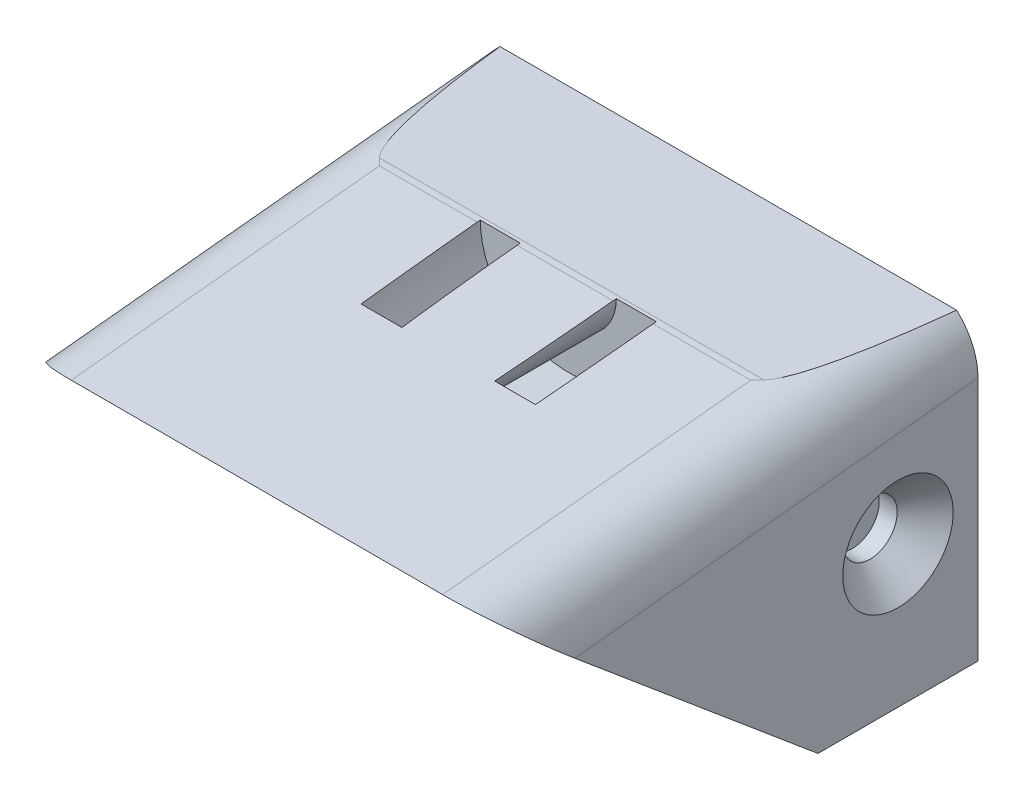
ISO-10303-21;
HEADER;
FILE_DESCRIPTION(('STEP AP214'),'2;1');
FILE_NAME('part.step','',(''),(''),'','','');
FILE_SCHEMA(('AUTOMOTIVE_DESIGN { 1 0 10303 214 1 1 1 1 }'));
ENDSEC;
DATA;
#1=APPLICATION_CONTEXT('core data for automotive mechanical design processes');
#2=APPLICATION_PROTOCOL_DEFINITION('international standard','automotive_design',2000,#1);
#3=PRODUCT_CONTEXT('',#1,'mechanical');
#4=PRODUCT('Part','Part','',(#3));
#5=PRODUCT_RELATED_PRODUCT_CATEGORY('part','',(#4));
#6=PRODUCT_DEFINITION_FORMATION('','',#4);
#7=PRODUCT_DEFINITION_CONTEXT('part definition',#1,'design');
#8=PRODUCT_DEFINITION('design','',#6,#7);
#9=PRODUCT_DEFINITION_SHAPE('','',#8);
#10=(LENGTH_UNIT() NAMED_UNIT(*) SI_UNIT(.MILLI.,.METRE.));
#11=(NAMED_UNIT(*) PLANE_ANGLE_UNIT() SI_UNIT($,.RADIAN.));
#12=(NAMED_UNIT(*) SI_UNIT($,.STERADIAN.) SOLID_ANGLE_UNIT());
#13=UNCERTAINTY_MEASURE_WITH_UNIT(LENGTH_MEASURE(1.E-05),#10,'distance_accuracy_value','');
#14=(GEOMETRIC_REPRESENTATION_CONTEXT(3) GLOBAL_UNCERTAINTY_ASSIGNED_CONTEXT((#13)) GLOBAL_UNIT_ASSIGNED_CONTEXT((#10,
#11,#12)) REPRESENTATION_CONTEXT('',''));
#15=CARTESIAN_POINT('',(0.,0.,0.));
#16=DIRECTION('',(0.,0.,1.));
#17=DIRECTION('',(1.,0.,0.));
#18=AXIS2_PLACEMENT_3D('',#15,#16,#17);
#19=CARTESIAN_POINT('',(-15.6000000000001,3.49063388062199,51.7809065631408));
#20=DIRECTION('',(0.,-0.994783421387812,-0.102009531574063));
#21=DIRECTION('',(0.,0.102009531574063,-0.994783421387812));
#22=AXIS2_PLACEMENT_3D('',#19,#20,#21);
#23=PLANE('',#22);
#24=CARTESIAN_POINT('',(0.,5.48589572499509,32.3233777079189));
#25=DIRECTION('',(0.,-0.994783421387812,-0.102009531574063));
#26=DIRECTION('',(0.,0.102009531574063,-0.994783421387812));
#27=AXIS2_PLACEMENT_3D('',#24,#25,#26);
#28=ELLIPSE('',#27,29.4090165272631,3.);
#29=CARTESIAN_POINT('',(2.99992743194253,5.46502941054633,32.5268632387197));
#30=VERTEX_POINT('',#29);
#31=CARTESIAN_POINT('',(2.89974319799854,4.71681225380281,39.8233777079189));
#32=VERTEX_POINT('',#31);
#33=EDGE_CURVE('E288',#30,#32,#28,.T.);
#34=ORIENTED_EDGE('',*,*,#33,.F.);
#35=DIRECTION('',(1.,0.,0.));
#36=VECTOR('',#35,1.);
#37=CARTESIAN_POINT('',(-15.6,5.46502941054633,32.5268632387196));
#38=LINE('',#37,#36);
#39=CARTESIAN_POINT('',(-2.99992743194254,5.46502941054633,32.5268632387197));
#40=VERTEX_POINT('',#39);
#41=EDGE_CURVE('E228',#30,#40,#38,.F.);
#42=ORIENTED_EDGE('',*,*,#41,.T.);
#43=CARTESIAN_POINT('',(-2.89974319799855,4.7168122538028,39.8233777079189));
#44=VERTEX_POINT('',#43);
#45=EDGE_CURVE('E283',#44,#40,#28,.T.);
#46=ORIENTED_EDGE('',*,*,#45,.F.);
#47=DIRECTION('',(-1.,0.,0.));
#48=VECTOR('',#47,1.);
#49=CARTESIAN_POINT('',(-15.6000000000001,4.71681225380279,39.8233777079189));
#50=LINE('',#49,#48);
#51=CARTESIAN_POINT('',(-5.44596278121131,4.7168122538028,39.8233777079189));
#52=VERTEX_POINT('',#51);
#53=EDGE_CURVE('E51',#44,#52,#50,.T.);
#54=ORIENTED_EDGE('',*,*,#53,.T.);
#55=CARTESIAN_POINT('',(0.,5.48589572499509,32.3233777079189));
#56=DIRECTION('',(0.,-0.994783421387812,-0.102009531574063));
#57=DIRECTION('',(0.,0.102009531574063,-0.994783421387812));
#58=AXIS2_PLACEMENT_3D('',#55,#56,#57);
#59=ELLIPSE('',#58,53.9165302999824,5.5);
#60=CARTESIAN_POINT('',(-5.49996041775951,5.46502941054633,32.5268632387197));
#61=VERTEX_POINT('',#60);
#62=EDGE_CURVE('E277',#61,#52,#59,.F.);
#63=ORIENTED_EDGE('',*,*,#62,.F.);
#64=CARTESIAN_POINT('',(-11.6,5.46502941054633,32.5268632387196));
#65=VERTEX_POINT('',#64);
#66=EDGE_CURVE('E273',#61,#65,#38,.F.);
#67=ORIENTED_EDGE('',*,*,#66,.T.);
#68=DIRECTION('',(0.,0.102009531574063,-0.994783421387812));
#69=VECTOR('',#68,1.);
#70=CARTESIAN_POINT('',(-11.6000000000001,3.49063388062199,51.7809065631408));
#71=LINE('',#70,#69);
#72=CARTESIAN_POINT('',(-11.6000000000001,3.490633880622,51.7809065631408));
#73=VERTEX_POINT('',#72);
#74=EDGE_CURVE('E495',#65,#73,#71,.F.);
#75=ORIENTED_EDGE('',*,*,#74,.T.);
#76=DIRECTION('',(1.,0.,0.));
#77=VECTOR('',#76,1.);
#78=CARTESIAN_POINT('',(-15.6000000000001,3.49063388062199,51.7809065631408));
#79=LINE('',#78,#77);
#80=CARTESIAN_POINT('',(11.5999999999999,3.49063388062201,51.780906563141));
#81=VERTEX_POINT('',#80);
#82=EDGE_CURVE('E440',#73,#81,#79,.T.);
#83=ORIENTED_EDGE('',*,*,#82,.T.);
#84=DIRECTION('',(0.,0.102009531574063,-0.994783421387812));
#85=VECTOR('',#84,1.);
#86=CARTESIAN_POINT('',(11.5999999999999,3.49063388062201,51.780906563141));
#87=LINE('',#86,#85);
#88=CARTESIAN_POINT('',(11.6,5.46502941054634,32.5268632387198));
#89=VERTEX_POINT('',#88);
#90=EDGE_CURVE('E488',#81,#89,#87,.T.);
#91=ORIENTED_EDGE('',*,*,#90,.T.);
#92=CARTESIAN_POINT('',(5.4999604177595,5.46502941054633,32.5268632387197));
#93=VERTEX_POINT('',#92);
#94=EDGE_CURVE('E491',#89,#93,#38,.F.);
#95=ORIENTED_EDGE('',*,*,#94,.T.);
#96=CARTESIAN_POINT('',(5.44596278121131,4.71681225380281,39.8233777079189));
#97=VERTEX_POINT('',#96);
#98=EDGE_CURVE('E284',#97,#93,#59,.F.);
#99=ORIENTED_EDGE('',*,*,#98,.F.);
#100=EDGE_CURVE('E11',#97,#32,#50,.T.);
#101=ORIENTED_EDGE('',*,*,#100,.T.);
#102=EDGE_LOOP('',(#34,#42,#46,#54,#63,#67,#75,#83,#91,#95,#99,#101));
#103=FACE_BOUND('',#102,.T.);
#104=ADVANCED_FACE('F47',(#103),#23,.F.);
#105=CARTESIAN_POINT('',(-15.6,1.48589572499508,32.1188251124234));
#106=DIRECTION('',(1.,0.,0.));
#107=DIRECTION('',(0.,0.,-1.));
#108=AXIS2_PLACEMENT_3D('',#105,#106,#107);
#109=CYLINDRICAL_SURFACE('',#108,4.);
#110=DIRECTION('',(1.,0.,0.));
#111=VECTOR('',#110,1.);
#112=CARTESIAN_POINT('',(-15.6,5.48066208057534,32.3233777079189));
#113=LINE('',#112,#111);
#114=CARTESIAN_POINT('',(-5.49999750990545,5.48066208057535,32.3233777079189));
#115=VERTEX_POINT('',#114);
#116=CARTESIAN_POINT('',(-2.99999543482421,5.48066208057535,32.3233777079189));
#117=VERTEX_POINT('',#116);
#118=EDGE_CURVE('E215',#115,#117,#113,.T.);
#119=ORIENTED_EDGE('',*,*,#118,.T.);
#120=CARTESIAN_POINT('',(-2.99999543482421,5.48066208057535,32.3233777079189));
#121=CARTESIAN_POINT('',(-2.99999446651074,5.47892195052373,32.3573584438906));
#122=CARTESIAN_POINT('',(-2.9999883154472,5.47674916299535,32.3913059394447));
#123=CARTESIAN_POINT('',(-2.99996564781997,5.47153827298552,32.4591344497116));
#124=CARTESIAN_POINT('',(-2.99994913125629,5.46850017050423,32.4930154644244));
#125=CARTESIAN_POINT('',(-2.99992743194254,5.46502941054633,32.5268632387197));
#126=B_SPLINE_CURVE_WITH_KNOTS('',3,(#120,#121,#122,#123,#124,#125),.UNSPECIFIED.,.F.,.F.,(4,2,
4),(0.,0.102050876923618,0.204101753828631),.UNSPECIFIED.);
#127=EDGE_CURVE('E221',#117,#40,#126,.T.);
#128=ORIENTED_EDGE('',*,*,#127,.T.);
#129=ORIENTED_EDGE('',*,*,#41,.F.);
#130=CARTESIAN_POINT('',(2.99992743194253,5.46502941054633,32.5268632387197));
#131=CARTESIAN_POINT('',(2.99994913125629,5.46850017050423,32.4930154644245));
#132=CARTESIAN_POINT('',(2.99996564781997,5.47153827298552,32.4591344497117));
#133=CARTESIAN_POINT('',(2.9999883154472,5.47674916299535,32.3913059394447));
#134=CARTESIAN_POINT('',(2.99999446651074,5.47892195052374,32.3573584438906));
#135=CARTESIAN_POINT('',(2.99999543482421,5.48066208057536,32.323377707919));
#136=B_SPLINE_CURVE_WITH_KNOTS('',3,(#130,#131,#132,#133,#134,#135),.UNSPECIFIED.,.F.,.F.,(4,2,
4),(0.,0.102050876905007,0.204101753828632),.UNSPECIFIED.);
#137=CARTESIAN_POINT('',(2.99999543482421,5.48066208057535,32.323377707919));
#138=VERTEX_POINT('',#137);
#139=EDGE_CURVE('E218',#30,#138,#136,.T.);
#140=ORIENTED_EDGE('',*,*,#139,.T.);
#141=CARTESIAN_POINT('',(5.5,5.48066208057535,32.3233777079191));
#142=VERTEX_POINT('',#141);
#143=EDGE_CURVE('E206',#138,#142,#113,.T.);
#144=ORIENTED_EDGE('',*,*,#143,.T.);
#145=CARTESIAN_POINT('',(5.49999750990544,5.48066208057535,32.323377707919));
#146=CARTESIAN_POINT('',(5.4999969817007,5.4789219507097,32.3573584414693));
#147=CARTESIAN_POINT('',(5.49999362658617,5.47674916327441,32.3913059358117));
#148=CARTESIAN_POINT('',(5.49998126253752,5.47153827326469,32.4591344460786));
#149=CARTESIAN_POINT('',(5.49997225360341,5.46850017069031,32.4930154620031));
#150=CARTESIAN_POINT('',(5.4999604177595,5.46502941054634,32.5268632387197));
#151=B_SPLINE_CURVE_WITH_KNOTS('',3,(#145,#146,#147,#148,#149,#150),.UNSPECIFIED.,.F.,.F.,(4,2,
4),(0.,0.102050872105921,0.204101744206301),.UNSPECIFIED.);
#152=EDGE_CURVE('E212',#142,#93,#151,.T.);
#153=ORIENTED_EDGE('',*,*,#152,.T.);
#154=ORIENTED_EDGE('',*,*,#94,.F.);
#155=CARTESIAN_POINT('',(11.6,1.48589572499509,32.1188251124235));
#156=DIRECTION('',(-0.707106781186543,0.0721316315216832,-0.703418103075281));
#157=DIRECTION('',(0.707106781186552,0.0721316315216838,-0.703418103075272));
#158=AXIS2_PLACEMENT_3D('',#155,#156,#157);
#159=ELLIPSE('',#158,5.65685424949238,4.);
#160=CARTESIAN_POINT('',(12.0080381262962,5.48589572499509,32.1188251124235));
#161=VERTEX_POINT('',#160);
#162=EDGE_CURVE('E306',#89,#161,#159,.T.);
#163=ORIENTED_EDGE('',*,*,#162,.T.);
#164=DIRECTION('',(1.,0.,0.));
#165=VECTOR('',#164,1.);
#166=CARTESIAN_POINT('',(-15.6,5.48589572499508,32.1188251124234));
#167=LINE('',#166,#165);
#168=CARTESIAN_POINT('',(-12.0080381262962,5.48589572499508,32.1188251124234));
#169=VERTEX_POINT('',#168);
#170=EDGE_CURVE('E482',#169,#161,#167,.T.);
#171=ORIENTED_EDGE('',*,*,#170,.F.);
#172=CARTESIAN_POINT('',(-11.6,1.48589572499508,32.1188251124234));
#173=DIRECTION('',(0.707106781186552,0.0721316315216838,-0.703418103075272));
#174=DIRECTION('',(0.707106781186543,-0.0721316315216832,0.703418103075281));
#175=AXIS2_PLACEMENT_3D('',#172,#173,#174);
#176=ELLIPSE('',#175,5.65685424949238,4.);
#177=EDGE_CURVE('E506',#65,#169,#176,.F.);
#178=ORIENTED_EDGE('',*,*,#177,.F.);
#179=ORIENTED_EDGE('',*,*,#66,.F.);
#180=CARTESIAN_POINT('',(-5.49996041775951,5.46502941054633,32.5268632387197));
#181=CARTESIAN_POINT('',(-5.49997225360341,5.4685001706903,32.4930154620031));
#182=CARTESIAN_POINT('',(-5.49998126253752,5.47153827326468,32.4591344460785));
#183=CARTESIAN_POINT('',(-5.49999362658617,5.4767491632744,32.3913059358116));
#184=CARTESIAN_POINT('',(-5.4999969817007,5.4789219507097,32.3573584414692));
#185=CARTESIAN_POINT('',(-5.49999750990545,5.48066208057535,32.3233777079189));
#186=B_SPLINE_CURVE_WITH_KNOTS('',3,(#180,#181,#182,#183,#184,#185),.UNSPECIFIED.,.F.,.F.,(4,2,
4),(0.,0.102050872100381,0.204101744206301),.UNSPECIFIED.);
#187=EDGE_CURVE('E233',#61,#115,#186,.T.);
#188=ORIENTED_EDGE('',*,*,#187,.T.);
#189=EDGE_LOOP('',(#119,#128,#129,#140,#144,#153,#154,#163,#171,#178,#179,#188));
#190=FACE_BOUND('',#189,.T.);
#191=ADVANCED_FACE('F226',(#190),#109,.T.);
#192=CARTESIAN_POINT('',(-15.6,-12.8361714054162,32.3233777079188));
#193=DIRECTION('',(0.,0.766044443118974,-0.642787609686544));
#194=DIRECTION('',(0.,0.642787609686544,0.766044443118975));
#195=AXIS2_PLACEMENT_3D('',#192,#193,#194);
#196=PLANE('',#195);
#197=ORIENTED_EDGE('',*,*,#82,.F.);
#198=CARTESIAN_POINT('',(-11.6000000000001,-0.0924600702233479,47.5107414746183));
#199=DIRECTION('',(0.,0.766044443118974,-0.642787609686544));
#200=DIRECTION('',(0.,0.642787609686544,0.766044443118975));
#201=AXIS2_PLACEMENT_3D('',#198,#199,#200);
#202=ELLIPSE('',#201,5.57430463320948,4.);
#203=CARTESIAN_POINT('',(-15.6000000000001,-0.0924600702233505,47.5107414746183));
#204=VERTEX_POINT('',#203);
#205=EDGE_CURVE('E501',#73,#204,#202,.F.);
#206=ORIENTED_EDGE('',*,*,#205,.T.);
#207=DIRECTION('',(0.,0.642787609686544,0.766044443118974));
#208=VECTOR('',#207,1.);
#209=CARTESIAN_POINT('',(-15.6,-12.8361714054162,32.3233777079188));
#210=LINE('',#209,#208);
#211=CARTESIAN_POINT('',(-15.6,-12.8361714054162,32.3233777079188));
#212=VERTEX_POINT('',#211);
#213=EDGE_CURVE('E436',#212,#204,#210,.T.);
#214=ORIENTED_EDGE('',*,*,#213,.F.);
#215=DIRECTION('',(1.,0.,0.));
#216=VECTOR('',#215,1.);
#217=CARTESIAN_POINT('',(-15.6,-12.8361714054162,32.3233777079188));
#218=LINE('',#217,#216);
#219=CARTESIAN_POINT('',(15.6,-12.8361714054162,32.3233777079191));
#220=VERTEX_POINT('',#219);
#221=EDGE_CURVE('E447',#212,#220,#218,.T.);
#222=ORIENTED_EDGE('',*,*,#221,.T.);
#223=DIRECTION('',(0.,0.642787609686544,0.766044443118974));
#224=VECTOR('',#223,1.);
#225=CARTESIAN_POINT('',(15.6,-12.8361714054162,32.3233777079191));
#226=LINE('',#225,#224);
#227=CARTESIAN_POINT('',(15.5999999999999,-0.0924600702233384,47.5107414746185));
#228=VERTEX_POINT('',#227);
#229=EDGE_CURVE('E435',#220,#228,#226,.T.);
#230=ORIENTED_EDGE('',*,*,#229,.T.);
#231=CARTESIAN_POINT('',(11.5999999999999,-0.0924600702233403,47.5107414746185));
#232=DIRECTION('',(0.,0.766044443118974,-0.642787609686544));
#233=DIRECTION('',(0.,-0.642787609686544,-0.766044443118975));
#234=AXIS2_PLACEMENT_3D('',#231,#232,#233);
#235=ELLIPSE('',#234,5.57430463320948,4.);
#236=EDGE_CURVE('E498',#228,#81,#235,.F.);
#237=ORIENTED_EDGE('',*,*,#236,.T.);
#238=EDGE_LOOP('',(#197,#206,#214,#222,#230,#237));
#239=FACE_BOUND('',#238,.T.);
#240=ADVANCED_FACE('F540',(#239),#196,.F.);
#241=CARTESIAN_POINT('',(-15.5999999999998,0.,-1.08779581284788E-13));
#242=DIRECTION('',(-1.,0.,0.));
#243=DIRECTION('',(0.,0.,1.));
#244=AXIS2_PLACEMENT_3D('',#241,#242,#243);
#245=PLANE('',#244);
#246=CARTESIAN_POINT('',(-15.6,-4.00000000000001,27.3233777079186));
#247=DIRECTION('',(-1.,0.,0.));
#248=DIRECTION('',(0.,0.,1.));
#249=AXIS2_PLACEMENT_3D('',#246,#247,#248);
#250=CIRCLE('',#249,3.45000000000002);
#251=CARTESIAN_POINT('',(-15.6,-4.00000000000001,30.7733777079187));
#252=VERTEX_POINT('',#251);
#253=EDGE_CURVE('E450',#252,#252,#250,.F.);
#254=ORIENTED_EDGE('',*,*,#253,.T.);
#255=EDGE_LOOP('',(#254));
#256=FACE_BOUND('',#255,.T.);
#257=ORIENTED_EDGE('',*,*,#213,.T.);
#258=DIRECTION('',(0.,0.102009531574063,-0.994783421387812));
#259=VECTOR('',#258,1.);
#260=CARTESIAN_POINT('',(-15.6,1.50676203944383,31.9153395816226));
#261=LINE('',#260,#259);
#262=CARTESIAN_POINT('',(-15.5999999999999,2.49036461722681,22.3233777079186));
#263=VERTEX_POINT('',#262);
#264=EDGE_CURVE('E469',#204,#263,#261,.T.);
#265=ORIENTED_EDGE('',*,*,#264,.T.);
#266=DIRECTION('',(0.,1.,0.));
#267=VECTOR('',#266,1.);
#268=CARTESIAN_POINT('',(-15.5999999999999,5.48589572499508,22.3233777079186));
#269=LINE('',#268,#267);
#270=CARTESIAN_POINT('',(-15.5999999999999,-12.8361714054162,22.3233777079186));
#271=VERTEX_POINT('',#270);
#272=EDGE_CURVE('E423',#271,#263,#269,.T.);
#273=ORIENTED_EDGE('',*,*,#272,.F.);
#274=DIRECTION('',(0.,0.,1.));
#275=VECTOR('',#274,1.);
#276=CARTESIAN_POINT('',(-15.5999999999999,-12.8361714054162,22.3233777079186));
#277=LINE('',#276,#275);
#278=EDGE_CURVE('E427',#271,#212,#277,.T.);
#279=ORIENTED_EDGE('',*,*,#278,.T.);
#280=EDGE_LOOP('',(#257,#265,#273,#279));
#281=FACE_BOUND('',#280,.T.);
#282=ADVANCED_FACE('F535',(#256,#281),#245,.T.);
#283=CARTESIAN_POINT('',(15.6000000000002,0.,1.09088854259024E-13));
#284=DIRECTION('',(-1.,0.,0.));
#285=DIRECTION('',(0.,0.,1.));
#286=AXIS2_PLACEMENT_3D('',#283,#284,#285);
#287=PLANE('',#286);
#288=CARTESIAN_POINT('',(15.6,-4.,27.3233777079188));
#289=DIRECTION('',(-1.,0.,0.));
#290=DIRECTION('',(0.,0.,1.));
#291=AXIS2_PLACEMENT_3D('',#288,#289,#290);
#292=CIRCLE('',#291,3.44999999999999);
#293=CARTESIAN_POINT('',(15.6,-4.,30.7733777079188));
#294=VERTEX_POINT('',#293);
#295=EDGE_CURVE('E465',#294,#294,#292,.T.);
#296=ORIENTED_EDGE('',*,*,#295,.T.);
#297=EDGE_LOOP('',(#296));
#298=FACE_BOUND('',#297,.T.);
#299=DIRECTION('',(0.,-1.,0.));
#300=VECTOR('',#299,1.);
#301=CARTESIAN_POINT('',(15.6000000000001,5.48589572499509,22.3233777079188));
#302=LINE('',#301,#300);
#303=CARTESIAN_POINT('',(15.6000000000001,2.49036461722682,22.3233777079188));
#304=VERTEX_POINT('',#303);
#305=CARTESIAN_POINT('',(15.6000000000001,-12.8361714054162,22.3233777079188));
#306=VERTEX_POINT('',#305);
#307=EDGE_CURVE('E417',#304,#306,#302,.T.);
#308=ORIENTED_EDGE('',*,*,#307,.F.);
#309=DIRECTION('',(0.,0.102009531574063,-0.994783421387812));
#310=VECTOR('',#309,1.);
#311=CARTESIAN_POINT('',(15.6000000000002,4.72976814554401,0.485011533774733));
#312=LINE('',#311,#310);
#313=EDGE_CURVE('E213',#304,#228,#312,.F.);
#314=ORIENTED_EDGE('',*,*,#313,.T.);
#315=ORIENTED_EDGE('',*,*,#229,.F.);
#316=DIRECTION('',(0.,0.,1.));
#317=VECTOR('',#316,1.);
#318=CARTESIAN_POINT('',(15.6000000000001,-12.8361714054162,22.3233777079188));
#319=LINE('',#318,#317);
#320=EDGE_CURVE('E431',#306,#220,#319,.T.);
#321=ORIENTED_EDGE('',*,*,#320,.F.);
#322=EDGE_LOOP('',(#308,#314,#315,#321));
#323=FACE_BOUND('',#322,.T.);
#324=ADVANCED_FACE('F547',(#298,#323),#287,.F.);
#325=CARTESIAN_POINT('',(-1.6020984863972E-13,0.,22.3233777079187));
#326=DIRECTION('',(0.,0.,-1.));
#327=DIRECTION('',(-1.,0.,0.));
#328=AXIS2_PLACEMENT_3D('',#325,#326,#327);
#329=PLANE('',#328);
#330=ORIENTED_EDGE('',*,*,#272,.T.);
#331=CARTESIAN_POINT('',(-11.5999999999999,2.49036461722681,22.3233777079187));
#332=DIRECTION('',(0.,0.,-1.));
#333=DIRECTION('',(0.,-1.,0.));
#334=AXIS2_PLACEMENT_3D('',#331,#332,#333);
#335=ELLIPSE('',#334,4.02097573602467,4.);
#336=CARTESIAN_POINT('',(-14.2683643065985,5.48589572499508,22.3233777079186));
#337=VERTEX_POINT('',#336);
#338=EDGE_CURVE('E476',#263,#337,#335,.T.);
#339=ORIENTED_EDGE('',*,*,#338,.T.);
#340=DIRECTION('',(1.,0.,0.));
#341=VECTOR('',#340,1.);
#342=CARTESIAN_POINT('',(-15.5999999999999,5.48589572499508,22.3233777079186));
#343=LINE('',#342,#341);
#344=CARTESIAN_POINT('',(14.2683643065986,5.48589572499509,22.3233777079188));
#345=VERTEX_POINT('',#344);
#346=EDGE_CURVE('E413',#337,#345,#343,.T.);
#347=ORIENTED_EDGE('',*,*,#346,.T.);
#348=CARTESIAN_POINT('',(11.6000000000001,2.49036461722682,22.3233777079188));
#349=DIRECTION('',(0.,0.,-1.));
#350=DIRECTION('',(0.,1.,0.));
#351=AXIS2_PLACEMENT_3D('',#348,#349,#350);
#352=ELLIPSE('',#351,4.02097573602467,4.);
#353=EDGE_CURVE('E473',#345,#304,#352,.T.);
#354=ORIENTED_EDGE('',*,*,#353,.T.);
#355=ORIENTED_EDGE('',*,*,#307,.T.);
#356=DIRECTION('',(-1.,0.,0.));
#357=VECTOR('',#356,1.);
#358=CARTESIAN_POINT('',(-15.5999999999999,-12.8361714054162,22.3233777079186));
#359=LINE('',#358,#357);
#360=EDGE_CURVE('E420',#306,#271,#359,.T.);
#361=ORIENTED_EDGE('',*,*,#360,.T.);
#362=EDGE_LOOP('',(#330,#339,#347,#354,#355,#361));
#363=FACE_BOUND('',#362,.T.);
#364=DIRECTION('',(-1.,0.,0.));
#365=VECTOR('',#364,1.);
#366=CARTESIAN_POINT('',(12.7250000000001,-11.125,22.3233777079188));
#367=LINE('',#366,#365);
#368=CARTESIAN_POINT('',(12.7250000000001,-11.125,22.3233777079188));
#369=VERTEX_POINT('',#368);
#370=CARTESIAN_POINT('',(9.47500000000007,-11.125,22.3233777079188));
#371=VERTEX_POINT('',#370);
#372=EDGE_CURVE('E381',#369,#371,#367,.T.);
#373=ORIENTED_EDGE('',*,*,#372,.F.);
#374=DIRECTION('',(0.,-1.,0.));
#375=VECTOR('',#374,1.);
#376=CARTESIAN_POINT('',(12.7250000000001,3.125,22.3233777079188));
#377=LINE('',#376,#375);
#378=CARTESIAN_POINT('',(12.7250000000001,3.125,22.3233777079188));
#379=VERTEX_POINT('',#378);
#380=EDGE_CURVE('E378',#379,#369,#377,.T.);
#381=ORIENTED_EDGE('',*,*,#380,.F.);
#382=DIRECTION('',(1.,0.,0.));
#383=VECTOR('',#382,1.);
#384=CARTESIAN_POINT('',(12.7250000000001,3.125,22.3233777079188));
#385=LINE('',#384,#383);
#386=CARTESIAN_POINT('',(9.475,3.125,22.3233777079188));
#387=VERTEX_POINT('',#386);
#388=EDGE_CURVE('E389',#387,#379,#385,.T.);
#389=ORIENTED_EDGE('',*,*,#388,.F.);
#390=DIRECTION('',(0.,1.,0.));
#391=VECTOR('',#390,1.);
#392=CARTESIAN_POINT('',(9.47500000000007,3.125,22.3233777079188));
#393=LINE('',#392,#391);
#394=EDGE_CURVE('E385',#371,#387,#393,.T.);
#395=ORIENTED_EDGE('',*,*,#394,.F.);
#396=EDGE_LOOP('',(#373,#381,#389,#395));
#397=FACE_BOUND('',#396,.T.);
#398=DIRECTION('',(1.,0.,0.));
#399=VECTOR('',#398,1.);
#400=CARTESIAN_POINT('',(-12.7249999999999,3.125,22.3233777079186));
#401=LINE('',#400,#399);
#402=CARTESIAN_POINT('',(-12.7249999999999,3.125,22.3233777079186));
#403=VERTEX_POINT('',#402);
#404=CARTESIAN_POINT('',(-9.47499999999993,3.125,22.3233777079187));
#405=VERTEX_POINT('',#404);
#406=EDGE_CURVE('E345',#403,#405,#401,.T.);
#407=ORIENTED_EDGE('',*,*,#406,.F.);
#408=DIRECTION('',(0.,1.,0.));
#409=VECTOR('',#408,1.);
#410=CARTESIAN_POINT('',(-12.7249999999999,3.125,22.3233777079186));
#411=LINE('',#410,#409);
#412=CARTESIAN_POINT('',(-12.7249999999999,-11.125,22.3233777079186));
#413=VERTEX_POINT('',#412);
#414=EDGE_CURVE('E342',#413,#403,#411,.T.);
#415=ORIENTED_EDGE('',*,*,#414,.F.);
#416=DIRECTION('',(-1.,0.,0.));
#417=VECTOR('',#416,1.);
#418=CARTESIAN_POINT('',(-12.7249999999999,-11.125,22.3233777079186));
#419=LINE('',#418,#417);
#420=CARTESIAN_POINT('',(-9.47499999999993,-11.125,22.3233777079187));
#421=VERTEX_POINT('',#420);
#422=EDGE_CURVE('E353',#421,#413,#419,.T.);
#423=ORIENTED_EDGE('',*,*,#422,.F.);
#424=DIRECTION('',(0.,-1.,0.));
#425=VECTOR('',#424,1.);
#426=CARTESIAN_POINT('',(-9.47499999999993,3.125,22.3233777079187));
#427=LINE('',#426,#425);
#428=EDGE_CURVE('E349',#405,#421,#427,.T.);
#429=ORIENTED_EDGE('',*,*,#428,.F.);
#430=EDGE_LOOP('',(#407,#415,#423,#429));
#431=FACE_BOUND('',#430,.T.);
#432=ADVANCED_FACE('F526',(#363,#397,#431),#329,.T.);
#433=CARTESIAN_POINT('',(-15.5999999999999,5.48589572499508,22.3233777079186));
#434=DIRECTION('',(0.,-1.,0.));
#435=DIRECTION('',(1.,0.,0.));
#436=AXIS2_PLACEMENT_3D('',#433,#434,#435);
#437=PLANE('',#436);
#438=ORIENTED_EDGE('',*,*,#346,.F.);
#439=CARTESIAN_POINT('',(-11.5999999999997,5.48589572499508,-6.88864432843196));
#440=DIRECTION('',(0.,-1.,0.));
#441=DIRECTION('',(0.,0.,1.));
#442=AXIS2_PLACEMENT_3D('',#439,#440,#441);
#443=ELLIPSE('',#442,39.2120220363508,4.);
#444=EDGE_CURVE('E485',#337,#169,#443,.F.);
#445=ORIENTED_EDGE('',*,*,#444,.T.);
#446=ORIENTED_EDGE('',*,*,#170,.T.);
#447=CARTESIAN_POINT('',(11.6000000000003,5.48589572499509,-6.8886443284318));
#448=DIRECTION('',(0.,-1.,0.));
#449=DIRECTION('',(0.,0.,-1.));
#450=AXIS2_PLACEMENT_3D('',#447,#448,#449);
#451=ELLIPSE('',#450,39.2120220363508,4.);
#452=EDGE_CURVE('E479',#161,#345,#451,.F.);
#453=ORIENTED_EDGE('',*,*,#452,.T.);
#454=EDGE_LOOP('',(#438,#445,#446,#453));
#455=FACE_BOUND('',#454,.T.);
#456=ADVANCED_FACE('F523',(#455),#437,.F.);
#457=CARTESIAN_POINT('',(-15.5999999999999,-12.8361714054162,22.3233777079186));
#458=DIRECTION('',(0.,1.,0.));
#459=DIRECTION('',(-1.,0.,0.));
#460=AXIS2_PLACEMENT_3D('',#457,#458,#459);
#461=PLANE('',#460);
#462=ORIENTED_EDGE('',*,*,#221,.F.);
#463=ORIENTED_EDGE('',*,*,#278,.F.);
#464=ORIENTED_EDGE('',*,*,#360,.F.);
#465=ORIENTED_EDGE('',*,*,#320,.T.);
#466=EDGE_LOOP('',(#462,#463,#464,#465));
#467=FACE_BOUND('',#466,.T.);
#468=ADVANCED_FACE('F543',(#467),#461,.F.);
#469=CARTESIAN_POINT('',(12.7250000000001,3.125,22.3233777079188));
#470=DIRECTION('',(-1.,0.,0.));
#471=DIRECTION('',(0.,0.,1.));
#472=AXIS2_PLACEMENT_3D('',#469,#470,#471);
#473=PLANE('',#472);
#474=CARTESIAN_POINT('',(12.725,-4.,27.3233777079188));
#475=DIRECTION('',(-1.,0.,0.));
#476=DIRECTION('',(0.,0.,1.));
#477=AXIS2_PLACEMENT_3D('',#474,#475,#476);
#478=CIRCLE('',#477,1.7);
#479=CARTESIAN_POINT('',(12.725,-4.,29.0233777079188));
#480=VERTEX_POINT('',#479);
#481=EDGE_CURVE('E337',#480,#480,#478,.T.);
#482=ORIENTED_EDGE('',*,*,#481,.F.);
#483=EDGE_LOOP('',(#482));
#484=FACE_BOUND('',#483,.T.);
#485=DIRECTION('',(0.,0.,1.));
#486=VECTOR('',#485,1.);
#487=CARTESIAN_POINT('',(12.7250000000001,-11.125,22.3233777079188));
#488=LINE('',#487,#486);
#489=CARTESIAN_POINT('',(12.7250000000001,-11.125,32.323377707919));
#490=VERTEX_POINT('',#489);
#491=EDGE_CURVE('E409',#369,#490,#488,.T.);
#492=ORIENTED_EDGE('',*,*,#491,.T.);
#493=DIRECTION('',(0.,-0.707106781186546,-0.707106781186549));
#494=VECTOR('',#493,1.);
#495=CARTESIAN_POINT('',(12.7250000000001,-11.125,32.323377707919));
#496=LINE('',#495,#494);
#497=CARTESIAN_POINT('',(12.725,-4.,39.4483777079191));
#498=VERTEX_POINT('',#497);
#499=EDGE_CURVE('E313',#498,#490,#496,.T.);
#500=ORIENTED_EDGE('',*,*,#499,.F.);
#501=DIRECTION('',(0.,-0.707106781186546,0.707106781186549));
#502=VECTOR('',#501,1.);
#503=CARTESIAN_POINT('',(12.725,-4.,39.4483777079191));
#504=LINE('',#503,#502);
#505=CARTESIAN_POINT('',(12.7250000000001,3.125,32.323377707919));
#506=VERTEX_POINT('',#505);
#507=EDGE_CURVE('E316',#506,#498,#504,.T.);
#508=ORIENTED_EDGE('',*,*,#507,.F.);
#509=DIRECTION('',(0.,0.,1.));
#510=VECTOR('',#509,1.);
#511=CARTESIAN_POINT('',(12.7250000000001,3.125,22.3233777079188));
#512=LINE('',#511,#510);
#513=EDGE_CURVE('E392',#379,#506,#512,.T.);
#514=ORIENTED_EDGE('',*,*,#513,.F.);
#515=ORIENTED_EDGE('',*,*,#380,.T.);
#516=EDGE_LOOP('',(#492,#500,#508,#514,#515));
#517=FACE_BOUND('',#516,.T.);
#518=ADVANCED_FACE('F606',(#484,#517),#473,.T.);
#519=CARTESIAN_POINT('',(12.7250000000001,-11.125,22.3233777079188));
#520=DIRECTION('',(0.,1.,0.));
#521=DIRECTION('',(0.,0.,1.));
#522=AXIS2_PLACEMENT_3D('',#519,#520,#521);
#523=PLANE('',#522);
#524=DIRECTION('',(-1.,0.,0.));
#525=VECTOR('',#524,1.);
#526=CARTESIAN_POINT('',(12.725,-11.125,32.323377707919));
#527=LINE('',#526,#525);
#528=CARTESIAN_POINT('',(9.475,-11.125,32.323377707919));
#529=VERTEX_POINT('',#528);
#530=EDGE_CURVE('E377',#490,#529,#527,.T.);
#531=ORIENTED_EDGE('',*,*,#530,.F.);
#532=ORIENTED_EDGE('',*,*,#491,.F.);
#533=ORIENTED_EDGE('',*,*,#372,.T.);
#534=DIRECTION('',(0.,0.,1.));
#535=VECTOR('',#534,1.);
#536=CARTESIAN_POINT('',(9.47500000000007,-11.125,22.3233777079188));
#537=LINE('',#536,#535);
#538=EDGE_CURVE('E405',#371,#529,#537,.T.);
#539=ORIENTED_EDGE('',*,*,#538,.T.);
#540=EDGE_LOOP('',(#531,#532,#533,#539));
#541=FACE_BOUND('',#540,.T.);
#542=ADVANCED_FACE('F609',(#541),#523,.T.);
#543=CARTESIAN_POINT('',(9.47500000000007,3.125,22.3233777079188));
#544=DIRECTION('',(1.,0.,0.));
#545=DIRECTION('',(0.,0.,-1.));
#546=AXIS2_PLACEMENT_3D('',#543,#544,#545);
#547=PLANE('',#546);
#548=CARTESIAN_POINT('',(9.47500000000004,-4.,27.3233777079188));
#549=DIRECTION('',(1.,0.,0.));
#550=DIRECTION('',(0.,0.,-1.));
#551=AXIS2_PLACEMENT_3D('',#548,#549,#550);
#552=CIRCLE('',#551,1.7);
#553=CARTESIAN_POINT('',(9.47500000000005,-4.,25.6233777079188));
#554=VERTEX_POINT('',#553);
#555=EDGE_CURVE('E333',#554,#554,#552,.T.);
#556=ORIENTED_EDGE('',*,*,#555,.F.);
#557=EDGE_LOOP('',(#556));
#558=FACE_BOUND('',#557,.T.);
#559=DIRECTION('',(0.,0.,1.));
#560=VECTOR('',#559,1.);
#561=CARTESIAN_POINT('',(9.47500000000007,3.125,22.3233777079188));
#562=LINE('',#561,#560);
#563=CARTESIAN_POINT('',(9.475,3.125,32.323377707919));
#564=VERTEX_POINT('',#563);
#565=EDGE_CURVE('E401',#387,#564,#562,.T.);
#566=ORIENTED_EDGE('',*,*,#565,.T.);
#567=DIRECTION('',(0.,-0.707106781186546,0.707106781186549));
#568=VECTOR('',#567,1.);
#569=CARTESIAN_POINT('',(9.47499999999995,-4.,39.448377707919));
#570=LINE('',#569,#568);
#571=CARTESIAN_POINT('',(9.47499999999995,-4.,39.448377707919));
#572=VERTEX_POINT('',#571);
#573=EDGE_CURVE('E317',#564,#572,#570,.T.);
#574=ORIENTED_EDGE('',*,*,#573,.T.);
#575=DIRECTION('',(0.,-0.707106781186546,-0.707106781186549));
#576=VECTOR('',#575,1.);
#577=CARTESIAN_POINT('',(9.475,-11.125,32.323377707919));
#578=LINE('',#577,#576);
#579=EDGE_CURVE('E312',#572,#529,#578,.T.);
#580=ORIENTED_EDGE('',*,*,#579,.T.);
#581=ORIENTED_EDGE('',*,*,#538,.F.);
#582=ORIENTED_EDGE('',*,*,#394,.T.);
#583=EDGE_LOOP('',(#566,#574,#580,#581,#582));
#584=FACE_BOUND('',#583,.T.);
#585=ADVANCED_FACE('F624',(#558,#584),#547,.T.);
#586=CARTESIAN_POINT('',(12.7250000000001,3.125,22.3233777079188));
#587=DIRECTION('',(0.,-1.,0.));
#588=DIRECTION('',(1.,0.,0.));
#589=AXIS2_PLACEMENT_3D('',#586,#587,#588);
#590=PLANE('',#589);
#591=DIRECTION('',(1.,0.,0.));
#592=VECTOR('',#591,1.);
#593=CARTESIAN_POINT('',(12.725,3.125,32.323377707919));
#594=LINE('',#593,#592);
#595=EDGE_CURVE('E382',#564,#506,#594,.T.);
#596=ORIENTED_EDGE('',*,*,#595,.F.);
#597=ORIENTED_EDGE('',*,*,#565,.F.);
#598=ORIENTED_EDGE('',*,*,#388,.T.);
#599=ORIENTED_EDGE('',*,*,#513,.T.);
#600=EDGE_LOOP('',(#596,#597,#598,#599));
#601=FACE_BOUND('',#600,.T.);
#602=ADVANCED_FACE('F631',(#601),#590,.T.);
#603=CARTESIAN_POINT('',(-12.7249999999999,3.125,22.3233777079186));
#604=DIRECTION('',(1.,0.,0.));
#605=DIRECTION('',(0.,0.,-1.));
#606=AXIS2_PLACEMENT_3D('',#603,#604,#605);
#607=PLANE('',#606);
#608=CARTESIAN_POINT('',(-12.725,-4.00000000000001,27.3233777079186));
#609=DIRECTION('',(1.,0.,0.));
#610=DIRECTION('',(0.,0.,-1.));
#611=AXIS2_PLACEMENT_3D('',#608,#609,#610);
#612=CIRCLE('',#611,1.7);
#613=CARTESIAN_POINT('',(-12.725,-4.00000000000001,25.6233777079186));
#614=VERTEX_POINT('',#613);
#615=EDGE_CURVE('E329',#614,#614,#612,.T.);
#616=ORIENTED_EDGE('',*,*,#615,.F.);
#617=EDGE_LOOP('',(#616));
#618=FACE_BOUND('',#617,.T.);
#619=DIRECTION('',(0.,0.,1.));
#620=VECTOR('',#619,1.);
#621=CARTESIAN_POINT('',(-12.7249999999999,3.125,22.3233777079186));
#622=LINE('',#621,#620);
#623=CARTESIAN_POINT('',(-12.725,3.125,32.323377707919));
#624=VERTEX_POINT('',#623);
#625=EDGE_CURVE('E373',#403,#624,#622,.T.);
#626=ORIENTED_EDGE('',*,*,#625,.T.);
#627=DIRECTION('',(0.,-0.707106781186546,0.707106781186549));
#628=VECTOR('',#627,1.);
#629=CARTESIAN_POINT('',(-12.725,-4.,39.4483777079191));
#630=LINE('',#629,#628);
#631=CARTESIAN_POINT('',(-12.725,-4.,39.4483777079191));
#632=VERTEX_POINT('',#631);
#633=EDGE_CURVE('E297',#624,#632,#630,.T.);
#634=ORIENTED_EDGE('',*,*,#633,.T.);
#635=DIRECTION('',(0.,-0.707106781186546,-0.707106781186549));
#636=VECTOR('',#635,1.);
#637=CARTESIAN_POINT('',(-12.725,-11.125,32.323377707919));
#638=LINE('',#637,#636);
#639=CARTESIAN_POINT('',(-12.725,-11.125,32.323377707919));
#640=VERTEX_POINT('',#639);
#641=EDGE_CURVE('E293',#632,#640,#638,.T.);
#642=ORIENTED_EDGE('',*,*,#641,.T.);
#643=DIRECTION('',(0.,0.,1.));
#644=VECTOR('',#643,1.);
#645=CARTESIAN_POINT('',(-12.7249999999999,-11.125,22.3233777079186));
#646=LINE('',#645,#644);
#647=EDGE_CURVE('E356',#413,#640,#646,.T.);
#648=ORIENTED_EDGE('',*,*,#647,.F.);
#649=ORIENTED_EDGE('',*,*,#414,.T.);
#650=EDGE_LOOP('',(#626,#634,#642,#648,#649));
#651=FACE_BOUND('',#650,.T.);
#652=ADVANCED_FACE('F633',(#618,#651),#607,.T.);
#653=CARTESIAN_POINT('',(-12.7249999999999,3.125,22.3233777079186));
#654=DIRECTION('',(0.,-1.,0.));
#655=DIRECTION('',(1.,0.,0.));
#656=AXIS2_PLACEMENT_3D('',#653,#654,#655);
#657=PLANE('',#656);
#658=DIRECTION('',(1.,0.,0.));
#659=VECTOR('',#658,1.);
#660=CARTESIAN_POINT('',(-12.725,3.125,32.3233777079189));
#661=LINE('',#660,#659);
#662=CARTESIAN_POINT('',(-9.475,3.125,32.3233777079189));
#663=VERTEX_POINT('',#662);
#664=EDGE_CURVE('E341',#624,#663,#661,.T.);
#665=ORIENTED_EDGE('',*,*,#664,.F.);
#666=ORIENTED_EDGE('',*,*,#625,.F.);
#667=ORIENTED_EDGE('',*,*,#406,.T.);
#668=DIRECTION('',(0.,0.,1.));
#669=VECTOR('',#668,1.);
#670=CARTESIAN_POINT('',(-9.47499999999993,3.125,22.3233777079187));
#671=LINE('',#670,#669);
#672=EDGE_CURVE('E369',#405,#663,#671,.T.);
#673=ORIENTED_EDGE('',*,*,#672,.T.);
#674=EDGE_LOOP('',(#665,#666,#667,#673));
#675=FACE_BOUND('',#674,.T.);
#676=ADVANCED_FACE('F639',(#675),#657,.T.);
#677=CARTESIAN_POINT('',(-9.47499999999993,3.125,22.3233777079187));
#678=DIRECTION('',(-1.,0.,0.));
#679=DIRECTION('',(0.,0.,1.));
#680=AXIS2_PLACEMENT_3D('',#677,#678,#679);
#681=PLANE('',#680);
#682=CARTESIAN_POINT('',(-9.47499999999996,-4.00000000000001,27.3233777079187));
#683=DIRECTION('',(-1.,0.,0.));
#684=DIRECTION('',(0.,0.,1.));
#685=AXIS2_PLACEMENT_3D('',#682,#683,#684);
#686=CIRCLE('',#685,1.7);
#687=CARTESIAN_POINT('',(-9.47499999999997,-4.00000000000001,29.0233777079187));
#688=VERTEX_POINT('',#687);
#689=EDGE_CURVE('E328',#688,#688,#686,.T.);
#690=ORIENTED_EDGE('',*,*,#689,.F.);
#691=EDGE_LOOP('',(#690));
#692=FACE_BOUND('',#691,.T.);
#693=DIRECTION('',(0.,0.,1.));
#694=VECTOR('',#693,1.);
#695=CARTESIAN_POINT('',(-9.47499999999993,-11.125,22.3233777079187));
#696=LINE('',#695,#694);
#697=CARTESIAN_POINT('',(-9.475,-11.125,32.323377707919));
#698=VERTEX_POINT('',#697);
#699=EDGE_CURVE('E365',#421,#698,#696,.T.);
#700=ORIENTED_EDGE('',*,*,#699,.T.);
#701=DIRECTION('',(0.,-0.707106781186546,-0.707106781186549));
#702=VECTOR('',#701,1.);
#703=CARTESIAN_POINT('',(-9.475,-11.125,32.323377707919));
#704=LINE('',#703,#702);
#705=CARTESIAN_POINT('',(-9.47499999999995,-4.,39.448377707919));
#706=VERTEX_POINT('',#705);
#707=EDGE_CURVE('E303',#706,#698,#704,.T.);
#708=ORIENTED_EDGE('',*,*,#707,.F.);
#709=DIRECTION('',(0.,-0.707106781186546,0.707106781186549));
#710=VECTOR('',#709,1.);
#711=CARTESIAN_POINT('',(-9.47499999999995,-4.,39.448377707919));
#712=LINE('',#711,#710);
#713=EDGE_CURVE('E298',#663,#706,#712,.T.);
#714=ORIENTED_EDGE('',*,*,#713,.F.);
#715=ORIENTED_EDGE('',*,*,#672,.F.);
#716=ORIENTED_EDGE('',*,*,#428,.T.);
#717=EDGE_LOOP('',(#700,#708,#714,#715,#716));
#718=FACE_BOUND('',#717,.T.);
#719=ADVANCED_FACE('F760',(#692,#718),#681,.T.);
#720=CARTESIAN_POINT('',(-12.7249999999999,-11.125,22.3233777079186));
#721=DIRECTION('',(0.,1.,0.));
#722=DIRECTION('',(-1.,0.,0.));
#723=AXIS2_PLACEMENT_3D('',#720,#721,#722);
#724=PLANE('',#723);
#725=DIRECTION('',(-1.,0.,0.));
#726=VECTOR('',#725,1.);
#727=CARTESIAN_POINT('',(-12.725,-11.125,32.3233777079189));
#728=LINE('',#727,#726);
#729=EDGE_CURVE('E346',#698,#640,#728,.T.);
#730=ORIENTED_EDGE('',*,*,#729,.F.);
#731=ORIENTED_EDGE('',*,*,#699,.F.);
#732=ORIENTED_EDGE('',*,*,#422,.T.);
#733=ORIENTED_EDGE('',*,*,#647,.T.);
#734=EDGE_LOOP('',(#730,#731,#732,#733));
#735=FACE_BOUND('',#734,.T.);
#736=ADVANCED_FACE('F770',(#735),#724,.T.);
#737=CARTESIAN_POINT('',(-15.6,-4.00000000000001,27.3233777079186));
#738=DIRECTION('',(1.,0.,0.));
#739=DIRECTION('',(0.,0.,-1.));
#740=AXIS2_PLACEMENT_3D('',#737,#738,#739);
#741=CYLINDRICAL_SURFACE('',#740,1.7);
#742=ORIENTED_EDGE('',*,*,#555,.T.);
#743=EDGE_LOOP('',(#742));
#744=FACE_BOUND('',#743,.T.);
#745=ORIENTED_EDGE('',*,*,#689,.T.);
#746=EDGE_LOOP('',(#745));
#747=FACE_BOUND('',#746,.T.);
#748=ADVANCED_FACE('F603',(#744,#747),#741,.F.);
#749=CARTESIAN_POINT('',(-13.8499999999999,-4.00000000000001,27.3233777079186));
#750=DIRECTION('',(-1.,0.,0.));
#751=DIRECTION('',(0.,0.,1.));
#752=AXIS2_PLACEMENT_3D('',#749,#750,#751);
#753=CIRCLE('',#752,1.7);
#754=CARTESIAN_POINT('',(-13.85,-4.00000000000001,29.0233777079186));
#755=VERTEX_POINT('',#754);
#756=EDGE_CURVE('E457',#755,#755,#753,.T.);
#757=ORIENTED_EDGE('',*,*,#756,.T.);
#758=EDGE_LOOP('',(#757));
#759=FACE_BOUND('',#758,.T.);
#760=ORIENTED_EDGE('',*,*,#615,.T.);
#761=EDGE_LOOP('',(#760));
#762=FACE_BOUND('',#761,.T.);
#763=ADVANCED_FACE('F601',(#759,#762),#741,.F.);
#764=CARTESIAN_POINT('',(13.8500000000001,-4.,27.3233777079188));
#765=DIRECTION('',(-1.,0.,0.));
#766=DIRECTION('',(0.,0.,1.));
#767=AXIS2_PLACEMENT_3D('',#764,#765,#766);
#768=CIRCLE('',#767,1.7);
#769=CARTESIAN_POINT('',(13.85,-4.,29.0233777079188));
#770=VERTEX_POINT('',#769);
#771=EDGE_CURVE('E461',#770,#770,#768,.F.);
#772=ORIENTED_EDGE('',*,*,#771,.T.);
#773=EDGE_LOOP('',(#772));
#774=FACE_BOUND('',#773,.T.);
#775=ORIENTED_EDGE('',*,*,#481,.T.);
#776=EDGE_LOOP('',(#775));
#777=FACE_BOUND('',#776,.T.);
#778=ADVANCED_FACE('F597',(#774,#777),#741,.F.);
#779=CARTESIAN_POINT('',(12.7250000000001,-11.125,32.323377707919));
#780=DIRECTION('',(0.,0.707106781186549,-0.707106781186546));
#781=DIRECTION('',(0.,0.707106781186546,0.707106781186549));
#782=AXIS2_PLACEMENT_3D('',#779,#780,#781);
#783=PLANE('',#782);
#784=ORIENTED_EDGE('',*,*,#579,.F.);
#785=DIRECTION('',(-1.,0.,0.));
#786=VECTOR('',#785,1.);
#787=CARTESIAN_POINT('',(12.725,-4.,39.4483777079191));
#788=LINE('',#787,#786);
#789=EDGE_CURVE('E320',#498,#572,#788,.T.);
#790=ORIENTED_EDGE('',*,*,#789,.F.);
#791=ORIENTED_EDGE('',*,*,#499,.T.);
#792=ORIENTED_EDGE('',*,*,#530,.T.);
#793=EDGE_LOOP('',(#784,#790,#791,#792));
#794=FACE_BOUND('',#793,.T.);
#795=ADVANCED_FACE('F600',(#794),#783,.T.);
#796=CARTESIAN_POINT('',(12.725,-4.,39.4483777079191));
#797=DIRECTION('',(0.,-0.707106781186549,-0.707106781186546));
#798=DIRECTION('',(0.,0.707106781186546,-0.707106781186549));
#799=AXIS2_PLACEMENT_3D('',#796,#797,#798);
#800=PLANE('',#799);
#801=ORIENTED_EDGE('',*,*,#573,.F.);
#802=ORIENTED_EDGE('',*,*,#595,.T.);
#803=ORIENTED_EDGE('',*,*,#507,.T.);
#804=ORIENTED_EDGE('',*,*,#789,.T.);
#805=EDGE_LOOP('',(#801,#802,#803,#804));
#806=FACE_BOUND('',#805,.T.);
#807=ADVANCED_FACE('F582',(#806),#800,.T.);
#808=CARTESIAN_POINT('',(-15.6,-4.00000000000001,27.3233777079186));
#809=DIRECTION('',(-1.,0.,0.));
#810=DIRECTION('',(0.,0.,1.));
#811=AXIS2_PLACEMENT_3D('',#808,#809,#810);
#812=CONICAL_SURFACE('',#811,3.45000000000002,0.78539816339745);
#813=ORIENTED_EDGE('',*,*,#756,.F.);
#814=EDGE_LOOP('',(#813));
#815=FACE_BOUND('',#814,.T.);
#816=ORIENTED_EDGE('',*,*,#253,.F.);
#817=EDGE_LOOP('',(#816));
#818=FACE_BOUND('',#817,.T.);
#819=ADVANCED_FACE('F575',(#815,#818),#812,.F.);
#820=CARTESIAN_POINT('',(13.8500000000001,-4.,27.3233777079188));
#821=DIRECTION('',(1.,0.,0.));
#822=DIRECTION('',(0.,0.,-1.));
#823=AXIS2_PLACEMENT_3D('',#820,#821,#822);
#824=CONICAL_SURFACE('',#823,1.7,0.785398163397452);
#825=ORIENTED_EDGE('',*,*,#295,.F.);
#826=EDGE_LOOP('',(#825));
#827=FACE_BOUND('',#826,.T.);
#828=ORIENTED_EDGE('',*,*,#771,.F.);
#829=EDGE_LOOP('',(#828));
#830=FACE_BOUND('',#829,.T.);
#831=ADVANCED_FACE('F581',(#827,#830),#824,.F.);
#832=CARTESIAN_POINT('',(-12.725,-11.125,32.323377707919));
#833=DIRECTION('',(0.,-0.707106781186549,0.707106781186546));
#834=DIRECTION('',(0.,-0.707106781186546,-0.707106781186549));
#835=AXIS2_PLACEMENT_3D('',#832,#833,#834);
#836=PLANE('',#835);
#837=ORIENTED_EDGE('',*,*,#707,.T.);
#838=ORIENTED_EDGE('',*,*,#729,.T.);
#839=ORIENTED_EDGE('',*,*,#641,.F.);
#840=DIRECTION('',(1.,0.,0.));
#841=VECTOR('',#840,1.);
#842=CARTESIAN_POINT('',(-12.725,-4.,39.4483777079191));
#843=LINE('',#842,#841);
#844=EDGE_CURVE('E302',#632,#706,#843,.T.);
#845=ORIENTED_EDGE('',*,*,#844,.T.);
#846=EDGE_LOOP('',(#837,#838,#839,#845));
#847=FACE_BOUND('',#846,.T.);
#848=ADVANCED_FACE('F587',(#847),#836,.F.);
#849=CARTESIAN_POINT('',(-12.725,-4.,39.4483777079191));
#850=DIRECTION('',(0.,0.707106781186549,0.707106781186546));
#851=DIRECTION('',(0.,-0.707106781186546,0.707106781186549));
#852=AXIS2_PLACEMENT_3D('',#849,#850,#851);
#853=PLANE('',#852);
#854=ORIENTED_EDGE('',*,*,#713,.T.);
#855=ORIENTED_EDGE('',*,*,#844,.F.);
#856=ORIENTED_EDGE('',*,*,#633,.F.);
#857=ORIENTED_EDGE('',*,*,#664,.T.);
#858=EDGE_LOOP('',(#854,#855,#856,#857));
#859=FACE_BOUND('',#858,.T.);
#860=ADVANCED_FACE('F259',(#859),#853,.F.);
#861=CARTESIAN_POINT('',(11.5999999999999,-0.488499804929241,51.3728684368447));
#862=DIRECTION('',(0.,0.102009531574063,-0.994783421387812));
#863=DIRECTION('',(0.,0.994783421387812,0.102009531574063));
#864=AXIS2_PLACEMENT_3D('',#861,#862,#863);
#865=CYLINDRICAL_SURFACE('',#864,4.);
#866=ORIENTED_EDGE('',*,*,#353,.F.);
#867=ORIENTED_EDGE('',*,*,#452,.F.);
#868=ORIENTED_EDGE('',*,*,#162,.F.);
#869=ORIENTED_EDGE('',*,*,#90,.F.);
#870=ORIENTED_EDGE('',*,*,#236,.F.);
#871=ORIENTED_EDGE('',*,*,#313,.F.);
#872=EDGE_LOOP('',(#866,#867,#868,#869,#870,#871));
#873=FACE_BOUND('',#872,.T.);
#874=ADVANCED_FACE('F49',(#873),#865,.T.);
#875=CARTESIAN_POINT('',(-11.5999999999998,4.729768145544,0.485011533774543));
#876=DIRECTION('',(0.,-0.102009531574063,0.994783421387812));
#877=DIRECTION('',(0.,-0.994783421387812,-0.102009531574063));
#878=AXIS2_PLACEMENT_3D('',#875,#876,#877);
#879=CYLINDRICAL_SURFACE('',#878,4.);
#880=ORIENTED_EDGE('',*,*,#205,.F.);
#881=ORIENTED_EDGE('',*,*,#74,.F.);
#882=ORIENTED_EDGE('',*,*,#177,.T.);
#883=ORIENTED_EDGE('',*,*,#444,.F.);
#884=ORIENTED_EDGE('',*,*,#338,.F.);
#885=ORIENTED_EDGE('',*,*,#264,.F.);
#886=EDGE_LOOP('',(#880,#881,#882,#883,#884,#885));
#887=FACE_BOUND('',#886,.T.);
#888=ADVANCED_FACE('F533',(#887),#879,.T.);
#889=CARTESIAN_POINT('',(0.,5.48589572499509,39.8233777079189));
#890=DIRECTION('',(0.,0.,1.));
#891=DIRECTION('',(1.,0.,0.));
#892=AXIS2_PLACEMENT_3D('',#889,#890,#891);
#893=PLANE('',#892);
#894=CARTESIAN_POINT('',(0.,5.48589572499509,39.8233777079189));
#895=DIRECTION('',(0.,0.,1.));
#896=DIRECTION('',(1.,0.,0.));
#897=AXIS2_PLACEMENT_3D('',#894,#895,#896);
#898=CIRCLE('',#897,5.5);
#899=EDGE_CURVE('E290',#52,#97,#898,.T.);
#900=ORIENTED_EDGE('',*,*,#899,.F.);
#901=ORIENTED_EDGE('',*,*,#53,.F.);
#902=CARTESIAN_POINT('',(0.,5.48589572499509,39.8233777079189));
#903=DIRECTION('',(0.,0.,-1.));
#904=DIRECTION('',(1.,0.,0.));
#905=AXIS2_PLACEMENT_3D('',#902,#903,#904);
#906=CIRCLE('',#905,3.);
#907=EDGE_CURVE('E551',#32,#44,#906,.T.);
#908=ORIENTED_EDGE('',*,*,#907,.F.);
#909=ORIENTED_EDGE('',*,*,#100,.F.);
#910=EDGE_LOOP('',(#900,#901,#908,#909));
#911=FACE_BOUND('',#910,.T.);
#912=ADVANCED_FACE('F256',(#911),#893,.F.);
#913=CARTESIAN_POINT('',(0.,5.48589572499509,39.8233777079189));
#914=DIRECTION('',(0.,0.,-1.));
#915=DIRECTION('',(-1.,0.,0.));
#916=AXIS2_PLACEMENT_3D('',#913,#914,#915);
#917=CYLINDRICAL_SURFACE('',#916,3.);
#918=ORIENTED_EDGE('',*,*,#33,.T.);
#919=ORIENTED_EDGE('',*,*,#907,.T.);
#920=ORIENTED_EDGE('',*,*,#45,.T.);
#921=ORIENTED_EDGE('',*,*,#127,.F.);
#922=CARTESIAN_POINT('',(0.,5.48589572499509,32.3233777079189));
#923=DIRECTION('',(0.,0.,-1.));
#924=DIRECTION('',(1.,0.,0.));
#925=AXIS2_PLACEMENT_3D('',#922,#923,#924);
#926=CIRCLE('',#925,3.);
#927=EDGE_CURVE('E63',#138,#117,#926,.T.);
#928=ORIENTED_EDGE('',*,*,#927,.F.);
#929=ORIENTED_EDGE('',*,*,#139,.F.);
#930=EDGE_LOOP('',(#918,#919,#920,#921,#928,#929));
#931=FACE_BOUND('',#930,.T.);
#932=ADVANCED_FACE('F217',(#931),#917,.T.);
#933=CARTESIAN_POINT('',(0.,5.48589572499509,39.8233777079189));
#934=DIRECTION('',(0.,0.,-1.));
#935=DIRECTION('',(-1.,0.,0.));
#936=AXIS2_PLACEMENT_3D('',#933,#934,#935);
#937=CYLINDRICAL_SURFACE('',#936,5.5);
#938=ORIENTED_EDGE('',*,*,#62,.T.);
#939=ORIENTED_EDGE('',*,*,#899,.T.);
#940=ORIENTED_EDGE('',*,*,#98,.T.);
#941=ORIENTED_EDGE('',*,*,#152,.F.);
#942=CARTESIAN_POINT('',(0.,5.48589572499509,32.3233777079189));
#943=DIRECTION('',(0.,0.,1.));
#944=DIRECTION('',(1.,0.,0.));
#945=AXIS2_PLACEMENT_3D('',#942,#943,#944);
#946=CIRCLE('',#945,5.5);
#947=EDGE_CURVE('E68',#115,#142,#946,.T.);
#948=ORIENTED_EDGE('',*,*,#947,.F.);
#949=ORIENTED_EDGE('',*,*,#187,.F.);
#950=EDGE_LOOP('',(#938,#939,#940,#941,#948,#949));
#951=FACE_BOUND('',#950,.T.);
#952=ADVANCED_FACE('F255',(#951),#937,.F.);
#953=CARTESIAN_POINT('',(0.,5.48589572499509,32.3233777079189));
#954=DIRECTION('',(0.,0.,1.));
#955=DIRECTION('',(1.,0.,0.));
#956=AXIS2_PLACEMENT_3D('',#953,#954,#955);
#957=PLANE('',#956);
#958=ORIENTED_EDGE('',*,*,#947,.T.);
#959=ORIENTED_EDGE('',*,*,#143,.F.);
#960=ORIENTED_EDGE('',*,*,#927,.T.);
#961=ORIENTED_EDGE('',*,*,#118,.F.);
#962=EDGE_LOOP('',(#958,#959,#960,#961));
#963=FACE_BOUND('',#962,.T.);
#964=ADVANCED_FACE('F207',(#963),#957,.T.);
#965=CLOSED_SHELL('',(#104,#191,#240,#282,#324,#432,#456,#468,#518,#542,#585,#602,#652,#676,
#719,#736,#748,#763,#778,#795,#807,#819,#831,#848,#860,#874,#888,#912,#932,#952,#964));
#966=MANIFOLD_SOLID_BREP('B2',#965);
#967=ADVANCED_BREP_SHAPE_REPRESENTATION('',(#18,#966),#14);
#968=SHAPE_DEFINITION_REPRESENTATION(#9,#967);
ENDSEC;
END-ISO-10303-21;
